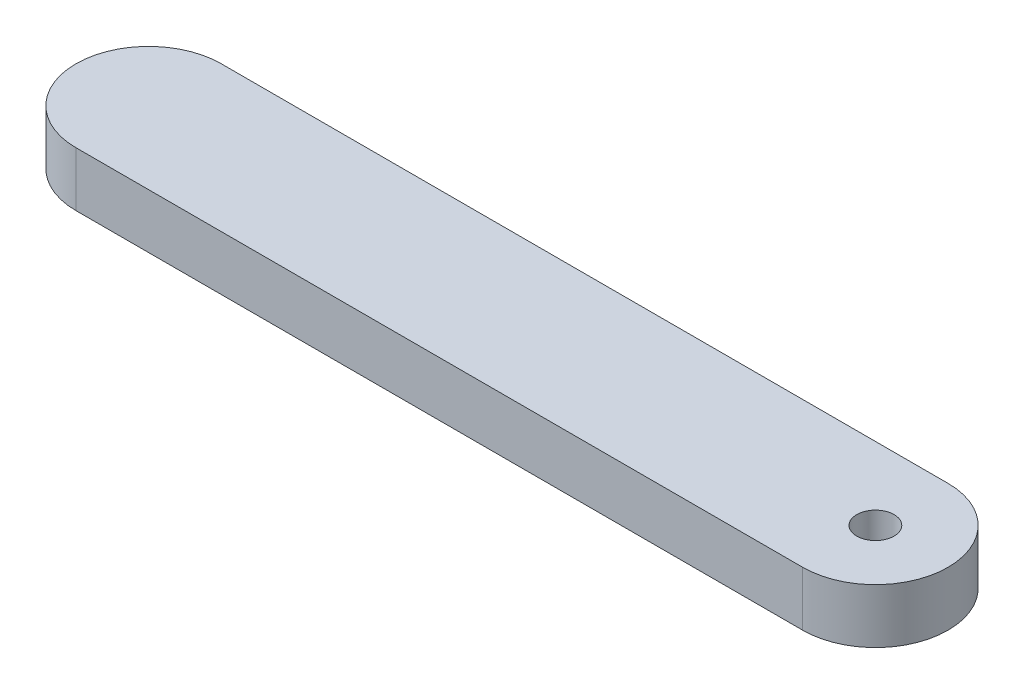
ISO-10303-21;
HEADER;
FILE_DESCRIPTION(('STEP AP214'),'2;1');
FILE_NAME('part.step','',(''),(''),'','','');
FILE_SCHEMA(('AUTOMOTIVE_DESIGN { 1 0 10303 214 1 1 1 1 }'));
ENDSEC;
DATA;
#1=APPLICATION_CONTEXT('core data for automotive mechanical design processes');
#2=APPLICATION_PROTOCOL_DEFINITION('international standard','automotive_design',2000,#1);
#3=PRODUCT_CONTEXT('',#1,'mechanical');
#4=PRODUCT('Part','Part','',(#3));
#5=PRODUCT_RELATED_PRODUCT_CATEGORY('part','',(#4));
#6=PRODUCT_DEFINITION_FORMATION('','',#4);
#7=PRODUCT_DEFINITION_CONTEXT('part definition',#1,'design');
#8=PRODUCT_DEFINITION('design','',#6,#7);
#9=PRODUCT_DEFINITION_SHAPE('','',#8);
#10=(LENGTH_UNIT() NAMED_UNIT(*) SI_UNIT(.MILLI.,.METRE.));
#11=(NAMED_UNIT(*) PLANE_ANGLE_UNIT() SI_UNIT($,.RADIAN.));
#12=(NAMED_UNIT(*) SI_UNIT($,.STERADIAN.) SOLID_ANGLE_UNIT());
#13=UNCERTAINTY_MEASURE_WITH_UNIT(LENGTH_MEASURE(1.E-05),#10,'distance_accuracy_value','');
#14=(GEOMETRIC_REPRESENTATION_CONTEXT(3) GLOBAL_UNCERTAINTY_ASSIGNED_CONTEXT((#13)) GLOBAL_UNIT_ASSIGNED_CONTEXT((#10,
#11,#12)) REPRESENTATION_CONTEXT('',''));
#15=CARTESIAN_POINT('',(0.,0.,0.));
#16=DIRECTION('',(0.,0.,1.));
#17=DIRECTION('',(1.,0.,0.));
#18=AXIS2_PLACEMENT_3D('',#15,#16,#17);
#19=CARTESIAN_POINT('',(0.,4.7625,6.35));
#20=DIRECTION('',(0.,0.,-1.));
#21=DIRECTION('',(-1.,0.,0.));
#22=AXIS2_PLACEMENT_3D('',#19,#20,#21);
#23=PLANE('',#22);
#24=DIRECTION('',(1.,0.,0.));
#25=VECTOR('',#24,1.);
#26=CARTESIAN_POINT('',(0.,0.,6.35));
#27=LINE('',#26,#25);
#28=CARTESIAN_POINT('',(-63.5,0.,6.35));
#29=VERTEX_POINT('',#28);
#30=CARTESIAN_POINT('',(0.,0.,6.35));
#31=VERTEX_POINT('',#30);
#32=EDGE_CURVE('E99',#29,#31,#27,.T.);
#33=ORIENTED_EDGE('',*,*,#32,.T.);
#34=DIRECTION('',(0.,-1.,0.));
#35=VECTOR('',#34,1.);
#36=CARTESIAN_POINT('',(0.,4.7625,6.35));
#37=LINE('',#36,#35);
#38=CARTESIAN_POINT('',(0.,4.7625,6.35));
#39=VERTEX_POINT('',#38);
#40=EDGE_CURVE('E11',#39,#31,#37,.T.);
#41=ORIENTED_EDGE('',*,*,#40,.F.);
#42=DIRECTION('',(1.,0.,0.));
#43=VECTOR('',#42,1.);
#44=CARTESIAN_POINT('',(0.,4.7625,6.35));
#45=LINE('',#44,#43);
#46=CARTESIAN_POINT('',(-63.5,4.7625,6.35));
#47=VERTEX_POINT('',#46);
#48=EDGE_CURVE('E84',#47,#39,#45,.T.);
#49=ORIENTED_EDGE('',*,*,#48,.F.);
#50=DIRECTION('',(0.,-1.,0.));
#51=VECTOR('',#50,1.);
#52=CARTESIAN_POINT('',(-63.5,4.7625,6.35));
#53=LINE('',#52,#51);
#54=EDGE_CURVE('E95',#47,#29,#53,.T.);
#55=ORIENTED_EDGE('',*,*,#54,.T.);
#56=EDGE_LOOP('',(#33,#41,#49,#55));
#57=FACE_BOUND('',#56,.T.);
#58=ADVANCED_FACE('F37',(#57),#23,.F.);
#59=CARTESIAN_POINT('',(0.,4.7625,0.));
#60=DIRECTION('',(0.,-1.,0.));
#61=DIRECTION('',(0.,0.,-1.));
#62=AXIS2_PLACEMENT_3D('',#59,#60,#61);
#63=CYLINDRICAL_SURFACE('',#62,6.35);
#64=CARTESIAN_POINT('',(0.,0.,0.));
#65=DIRECTION('',(0.,1.,0.));
#66=DIRECTION('',(0.,0.,1.));
#67=AXIS2_PLACEMENT_3D('',#64,#65,#66);
#68=CIRCLE('',#67,6.35);
#69=CARTESIAN_POINT('',(0.,0.,-6.35));
#70=VERTEX_POINT('',#69);
#71=EDGE_CURVE('E89',#31,#70,#68,.T.);
#72=ORIENTED_EDGE('',*,*,#71,.T.);
#73=DIRECTION('',(0.,-1.,0.));
#74=VECTOR('',#73,1.);
#75=CARTESIAN_POINT('',(0.,4.7625,-6.35));
#76=LINE('',#75,#74);
#77=CARTESIAN_POINT('',(0.,4.7625,-6.35));
#78=VERTEX_POINT('',#77);
#79=EDGE_CURVE('E45',#78,#70,#76,.T.);
#80=ORIENTED_EDGE('',*,*,#79,.F.);
#81=CARTESIAN_POINT('',(0.,4.7625,0.));
#82=DIRECTION('',(0.,1.,0.));
#83=DIRECTION('',(0.,0.,1.));
#84=AXIS2_PLACEMENT_3D('',#81,#82,#83);
#85=CIRCLE('',#84,6.35);
#86=EDGE_CURVE('E79',#39,#78,#85,.T.);
#87=ORIENTED_EDGE('',*,*,#86,.F.);
#88=ORIENTED_EDGE('',*,*,#40,.T.);
#89=EDGE_LOOP('',(#72,#80,#87,#88));
#90=FACE_BOUND('',#89,.T.);
#91=ADVANCED_FACE('F88',(#90),#63,.T.);
#92=CARTESIAN_POINT('',(0.,4.7625,-6.35));
#93=DIRECTION('',(0.,0.,-1.));
#94=DIRECTION('',(-1.,0.,0.));
#95=AXIS2_PLACEMENT_3D('',#92,#93,#94);
#96=PLANE('',#95);
#97=DIRECTION('',(1.,0.,0.));
#98=VECTOR('',#97,1.);
#99=CARTESIAN_POINT('',(0.,0.,-6.35));
#100=LINE('',#99,#98);
#101=CARTESIAN_POINT('',(-63.5,0.,-6.35));
#102=VERTEX_POINT('',#101);
#103=EDGE_CURVE('E104',#102,#70,#100,.T.);
#104=ORIENTED_EDGE('',*,*,#103,.F.);
#105=DIRECTION('',(0.,-1.,0.));
#106=VECTOR('',#105,1.);
#107=CARTESIAN_POINT('',(-63.5,4.7625,-6.35));
#108=LINE('',#107,#106);
#109=CARTESIAN_POINT('',(-63.5,4.7625,-6.35));
#110=VERTEX_POINT('',#109);
#111=EDGE_CURVE('E69',#110,#102,#108,.T.);
#112=ORIENTED_EDGE('',*,*,#111,.F.);
#113=DIRECTION('',(1.,0.,0.));
#114=VECTOR('',#113,1.);
#115=CARTESIAN_POINT('',(0.,4.7625,-6.35));
#116=LINE('',#115,#114);
#117=EDGE_CURVE('E82',#110,#78,#116,.T.);
#118=ORIENTED_EDGE('',*,*,#117,.T.);
#119=ORIENTED_EDGE('',*,*,#79,.T.);
#120=EDGE_LOOP('',(#104,#112,#118,#119));
#121=FACE_BOUND('',#120,.T.);
#122=ADVANCED_FACE('F93',(#121),#96,.T.);
#123=CARTESIAN_POINT('',(-63.5,4.7625,0.));
#124=DIRECTION('',(0.,-1.,0.));
#125=DIRECTION('',(0.,0.,-1.));
#126=AXIS2_PLACEMENT_3D('',#123,#124,#125);
#127=CYLINDRICAL_SURFACE('',#126,6.35);
#128=CARTESIAN_POINT('',(-63.5,0.,0.));
#129=DIRECTION('',(0.,1.,0.));
#130=DIRECTION('',(0.,0.,1.));
#131=AXIS2_PLACEMENT_3D('',#128,#129,#130);
#132=CIRCLE('',#131,6.35);
#133=EDGE_CURVE('E72',#102,#29,#132,.T.);
#134=ORIENTED_EDGE('',*,*,#133,.T.);
#135=ORIENTED_EDGE('',*,*,#54,.F.);
#136=CARTESIAN_POINT('',(-63.5,4.7625,0.));
#137=DIRECTION('',(0.,1.,0.));
#138=DIRECTION('',(0.,0.,1.));
#139=AXIS2_PLACEMENT_3D('',#136,#137,#138);
#140=CIRCLE('',#139,6.35);
#141=EDGE_CURVE('E53',#110,#47,#140,.T.);
#142=ORIENTED_EDGE('',*,*,#141,.F.);
#143=ORIENTED_EDGE('',*,*,#111,.T.);
#144=EDGE_LOOP('',(#134,#135,#142,#143));
#145=FACE_BOUND('',#144,.T.);
#146=ADVANCED_FACE('F122',(#145),#127,.T.);
#147=CARTESIAN_POINT('',(0.,4.7625,0.));
#148=DIRECTION('',(0.,1.,0.));
#149=DIRECTION('',(0.,0.,1.));
#150=AXIS2_PLACEMENT_3D('',#147,#148,#149);
#151=PLANE('',#150);
#152=CARTESIAN_POINT('',(0.,4.7625,0.));
#153=DIRECTION('',(0.,1.,0.));
#154=DIRECTION('',(0.,0.,1.));
#155=AXIS2_PLACEMENT_3D('',#152,#153,#154);
#156=CIRCLE('',#155,1.63195);
#157=CARTESIAN_POINT('',(0.,4.7625,1.63195));
#158=VERTEX_POINT('',#157);
#159=EDGE_CURVE('E173',#158,#158,#156,.T.);
#160=ORIENTED_EDGE('',*,*,#159,.F.);
#161=EDGE_LOOP('',(#160));
#162=FACE_BOUND('',#161,.T.);
#163=ORIENTED_EDGE('',*,*,#48,.T.);
#164=ORIENTED_EDGE('',*,*,#86,.T.);
#165=ORIENTED_EDGE('',*,*,#117,.F.);
#166=ORIENTED_EDGE('',*,*,#141,.T.);
#167=EDGE_LOOP('',(#163,#164,#165,#166));
#168=FACE_BOUND('',#167,.T.);
#169=ADVANCED_FACE('F80',(#162,#168),#151,.T.);
#170=CARTESIAN_POINT('',(0.,0.,0.));
#171=DIRECTION('',(0.,1.,0.));
#172=DIRECTION('',(0.,0.,1.));
#173=AXIS2_PLACEMENT_3D('',#170,#171,#172);
#174=PLANE('',#173);
#175=CARTESIAN_POINT('',(0.,0.,0.));
#176=DIRECTION('',(0.,1.,0.));
#177=DIRECTION('',(0.,0.,1.));
#178=AXIS2_PLACEMENT_3D('',#175,#176,#177);
#179=CIRCLE('',#178,1.63195);
#180=CARTESIAN_POINT('',(0.,0.,1.63195));
#181=VERTEX_POINT('',#180);
#182=EDGE_CURVE('E102',#181,#181,#179,.T.);
#183=ORIENTED_EDGE('',*,*,#182,.T.);
#184=EDGE_LOOP('',(#183));
#185=FACE_BOUND('',#184,.T.);
#186=ORIENTED_EDGE('',*,*,#32,.F.);
#187=ORIENTED_EDGE('',*,*,#133,.F.);
#188=ORIENTED_EDGE('',*,*,#103,.T.);
#189=ORIENTED_EDGE('',*,*,#71,.F.);
#190=EDGE_LOOP('',(#186,#187,#188,#189));
#191=FACE_BOUND('',#190,.T.);
#192=ADVANCED_FACE('F111',(#185,#191),#174,.F.);
#193=CARTESIAN_POINT('',(0.,4.7625,0.));
#194=DIRECTION('',(0.,1.,0.));
#195=DIRECTION('',(0.,0.,1.));
#196=AXIS2_PLACEMENT_3D('',#193,#194,#195);
#197=CYLINDRICAL_SURFACE('',#196,1.63195);
#198=ORIENTED_EDGE('',*,*,#182,.F.);
#199=EDGE_LOOP('',(#198));
#200=FACE_BOUND('',#199,.T.);
#201=ORIENTED_EDGE('',*,*,#159,.T.);
#202=EDGE_LOOP('',(#201));
#203=FACE_BOUND('',#202,.T.);
#204=ADVANCED_FACE('F113',(#200,#203),#197,.F.);
#205=CLOSED_SHELL('',(#58,#91,#122,#146,#169,#192,#204));
#206=MANIFOLD_SOLID_BREP('B2',#205);
#207=ADVANCED_BREP_SHAPE_REPRESENTATION('',(#18,#206),#14);
#208=SHAPE_DEFINITION_REPRESENTATION(#9,#207);
ENDSEC;
END-ISO-10303-21;
